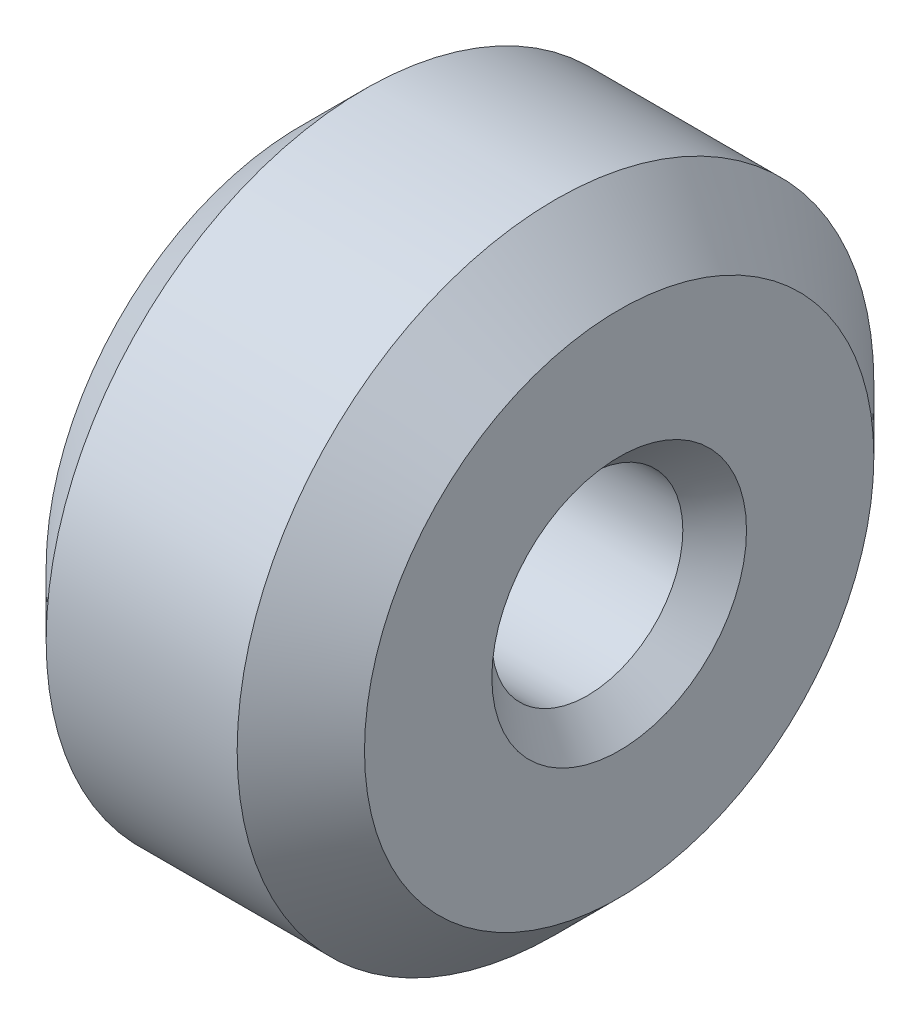
ISO-10303-21;
HEADER;
FILE_DESCRIPTION(('STEP AP214'),'2;1');
FILE_NAME('part.step','',(''),(''),'','','');
FILE_SCHEMA(('AUTOMOTIVE_DESIGN { 1 0 10303 214 1 1 1 1 }'));
ENDSEC;
DATA;
#1=APPLICATION_CONTEXT('core data for automotive mechanical design processes');
#2=APPLICATION_PROTOCOL_DEFINITION('international standard','automotive_design',2000,#1);
#3=PRODUCT_CONTEXT('',#1,'mechanical');
#4=PRODUCT('Part','Part','',(#3));
#5=PRODUCT_RELATED_PRODUCT_CATEGORY('part','',(#4));
#6=PRODUCT_DEFINITION_FORMATION('','',#4);
#7=PRODUCT_DEFINITION_CONTEXT('part definition',#1,'design');
#8=PRODUCT_DEFINITION('design','',#6,#7);
#9=PRODUCT_DEFINITION_SHAPE('','',#8);
#10=(LENGTH_UNIT() NAMED_UNIT(*) SI_UNIT(.MILLI.,.METRE.));
#11=(NAMED_UNIT(*) PLANE_ANGLE_UNIT() SI_UNIT($,.RADIAN.));
#12=(NAMED_UNIT(*) SI_UNIT($,.STERADIAN.) SOLID_ANGLE_UNIT());
#13=UNCERTAINTY_MEASURE_WITH_UNIT(LENGTH_MEASURE(1.E-05),#10,'distance_accuracy_value','');
#14=(GEOMETRIC_REPRESENTATION_CONTEXT(3) GLOBAL_UNCERTAINTY_ASSIGNED_CONTEXT((#13)) GLOBAL_UNIT_ASSIGNED_CONTEXT((#10,
#11,#12)) REPRESENTATION_CONTEXT('',''));
#15=CARTESIAN_POINT('',(0.,0.,0.));
#16=DIRECTION('',(0.,0.,1.));
#17=DIRECTION('',(1.,0.,0.));
#18=AXIS2_PLACEMENT_3D('',#15,#16,#17);
#19=CARTESIAN_POINT('',(0.,0.,0.));
#20=DIRECTION('',(-1.,0.,0.));
#21=DIRECTION('',(0.,0.,1.));
#22=AXIS2_PLACEMENT_3D('',#19,#20,#21);
#23=PLANE('',#22);
#24=CARTESIAN_POINT('',(0.,0.,0.));
#25=DIRECTION('',(-1.,0.,0.));
#26=DIRECTION('',(0.,0.,1.));
#27=AXIS2_PLACEMENT_3D('',#24,#25,#26);
#28=CIRCLE('',#27,8.);
#29=CARTESIAN_POINT('',(0.,0.,8.));
#30=VERTEX_POINT('',#29);
#31=EDGE_CURVE('E54',#30,#30,#28,.T.);
#32=ORIENTED_EDGE('',*,*,#31,.T.);
#33=EDGE_LOOP('',(#32));
#34=FACE_BOUND('',#33,.T.);
#35=CARTESIAN_POINT('',(0.,0.,0.));
#36=DIRECTION('',(-1.,0.,0.));
#37=DIRECTION('',(0.,0.,1.));
#38=AXIS2_PLACEMENT_3D('',#35,#36,#37);
#39=CIRCLE('',#38,3.);
#40=CARTESIAN_POINT('',(0.,0.,3.));
#41=VERTEX_POINT('',#40);
#42=EDGE_CURVE('E57',#41,#41,#39,.T.);
#43=ORIENTED_EDGE('',*,*,#42,.F.);
#44=EDGE_LOOP('',(#43));
#45=FACE_BOUND('',#44,.T.);
#46=ADVANCED_FACE('F31',(#34,#45),#23,.T.);
#47=CARTESIAN_POINT('',(0.,0.,0.));
#48=DIRECTION('',(-1.,0.,0.));
#49=DIRECTION('',(0.,0.,1.));
#50=AXIS2_PLACEMENT_3D('',#47,#48,#49);
#51=CYLINDRICAL_SURFACE('',#50,3.);
#52=CARTESIAN_POINT('',(9.,0.,0.));
#53=DIRECTION('',(1.,0.,0.));
#54=DIRECTION('',(0.,0.,-1.));
#55=AXIS2_PLACEMENT_3D('',#52,#53,#54);
#56=CIRCLE('',#55,3.);
#57=CARTESIAN_POINT('',(9.,0.,-3.));
#58=VERTEX_POINT('',#57);
#59=EDGE_CURVE('E10',#58,#58,#56,.T.);
#60=ORIENTED_EDGE('',*,*,#59,.T.);
#61=EDGE_LOOP('',(#60));
#62=FACE_BOUND('',#61,.T.);
#63=ORIENTED_EDGE('',*,*,#42,.T.);
#64=EDGE_LOOP('',(#63));
#65=FACE_BOUND('',#64,.T.);
#66=ADVANCED_FACE('F61',(#62,#65),#51,.F.);
#67=CARTESIAN_POINT('',(10.,0.,0.));
#68=DIRECTION('',(1.,0.,0.));
#69=DIRECTION('',(0.,0.,-1.));
#70=AXIS2_PLACEMENT_3D('',#67,#68,#69);
#71=PLANE('',#70);
#72=CARTESIAN_POINT('',(10.,0.,0.));
#73=DIRECTION('',(1.,0.,0.));
#74=DIRECTION('',(0.,0.,-1.));
#75=AXIS2_PLACEMENT_3D('',#72,#73,#74);
#76=CIRCLE('',#75,4.);
#77=CARTESIAN_POINT('',(10.,0.,-4.));
#78=VERTEX_POINT('',#77);
#79=EDGE_CURVE('E38',#78,#78,#76,.F.);
#80=ORIENTED_EDGE('',*,*,#79,.T.);
#81=EDGE_LOOP('',(#80));
#82=FACE_BOUND('',#81,.T.);
#83=CARTESIAN_POINT('',(10.,0.,0.));
#84=DIRECTION('',(1.,0.,0.));
#85=DIRECTION('',(0.,0.,-1.));
#86=AXIS2_PLACEMENT_3D('',#83,#84,#85);
#87=CIRCLE('',#86,7.99999999999999);
#88=CARTESIAN_POINT('',(10.,0.,-7.99999999999999));
#89=VERTEX_POINT('',#88);
#90=EDGE_CURVE('E42',#89,#89,#87,.T.);
#91=ORIENTED_EDGE('',*,*,#90,.T.);
#92=EDGE_LOOP('',(#91));
#93=FACE_BOUND('',#92,.T.);
#94=ADVANCED_FACE('F69',(#82,#93),#71,.T.);
#95=CARTESIAN_POINT('',(0.,0.,0.));
#96=DIRECTION('',(-1.,0.,0.));
#97=DIRECTION('',(0.,0.,1.));
#98=AXIS2_PLACEMENT_3D('',#95,#96,#97);
#99=CYLINDRICAL_SURFACE('',#98,10.);
#100=CARTESIAN_POINT('',(2.00000000000001,0.,0.));
#101=DIRECTION('',(-1.,0.,0.));
#102=DIRECTION('',(0.,0.,1.));
#103=AXIS2_PLACEMENT_3D('',#100,#101,#102);
#104=CIRCLE('',#103,10.);
#105=CARTESIAN_POINT('',(2.00000000000001,0.,10.));
#106=VERTEX_POINT('',#105);
#107=EDGE_CURVE('E46',#106,#106,#104,.F.);
#108=ORIENTED_EDGE('',*,*,#107,.T.);
#109=EDGE_LOOP('',(#108));
#110=FACE_BOUND('',#109,.T.);
#111=CARTESIAN_POINT('',(8.,0.,0.));
#112=DIRECTION('',(1.,0.,0.));
#113=DIRECTION('',(0.,0.,-1.));
#114=AXIS2_PLACEMENT_3D('',#111,#112,#113);
#115=CIRCLE('',#114,10.);
#116=CARTESIAN_POINT('',(8.,0.,-10.));
#117=VERTEX_POINT('',#116);
#118=EDGE_CURVE('E51',#117,#117,#115,.F.);
#119=ORIENTED_EDGE('',*,*,#118,.T.);
#120=EDGE_LOOP('',(#119));
#121=FACE_BOUND('',#120,.T.);
#122=ADVANCED_FACE('F76',(#110,#121),#99,.T.);
#123=CARTESIAN_POINT('',(0.,0.,0.));
#124=DIRECTION('',(1.,0.,0.));
#125=DIRECTION('',(0.,0.,-1.));
#126=AXIS2_PLACEMENT_3D('',#123,#124,#125);
#127=CONICAL_SURFACE('',#126,8.,0.785398163397447);
#128=ORIENTED_EDGE('',*,*,#107,.F.);
#129=EDGE_LOOP('',(#128));
#130=FACE_BOUND('',#129,.T.);
#131=ORIENTED_EDGE('',*,*,#31,.F.);
#132=EDGE_LOOP('',(#131));
#133=FACE_BOUND('',#132,.T.);
#134=ADVANCED_FACE('F73',(#130,#133),#127,.T.);
#135=CARTESIAN_POINT('',(8.,0.,0.));
#136=DIRECTION('',(-1.,0.,0.));
#137=DIRECTION('',(0.,0.,1.));
#138=AXIS2_PLACEMENT_3D('',#135,#136,#137);
#139=CONICAL_SURFACE('',#138,10.,0.78539816339745);
#140=ORIENTED_EDGE('',*,*,#90,.F.);
#141=EDGE_LOOP('',(#140));
#142=FACE_BOUND('',#141,.T.);
#143=ORIENTED_EDGE('',*,*,#118,.F.);
#144=EDGE_LOOP('',(#143));
#145=FACE_BOUND('',#144,.T.);
#146=ADVANCED_FACE('F75',(#142,#145),#139,.T.);
#147=CARTESIAN_POINT('',(10.,0.,0.));
#148=DIRECTION('',(1.,0.,0.));
#149=DIRECTION('',(0.,0.,-1.));
#150=AXIS2_PLACEMENT_3D('',#147,#148,#149);
#151=CONICAL_SURFACE('',#150,4.,0.785398163397447);
#152=ORIENTED_EDGE('',*,*,#59,.F.);
#153=EDGE_LOOP('',(#152));
#154=FACE_BOUND('',#153,.T.);
#155=ORIENTED_EDGE('',*,*,#79,.F.);
#156=EDGE_LOOP('',(#155));
#157=FACE_BOUND('',#156,.T.);
#158=ADVANCED_FACE('F33',(#154,#157),#151,.F.);
#159=CLOSED_SHELL('',(#46,#66,#94,#122,#134,#146,#158));
#160=MANIFOLD_SOLID_BREP('B2',#159);
#161=ADVANCED_BREP_SHAPE_REPRESENTATION('',(#18,#160),#14);
#162=SHAPE_DEFINITION_REPRESENTATION(#9,#161);
ENDSEC;
END-ISO-10303-21;
